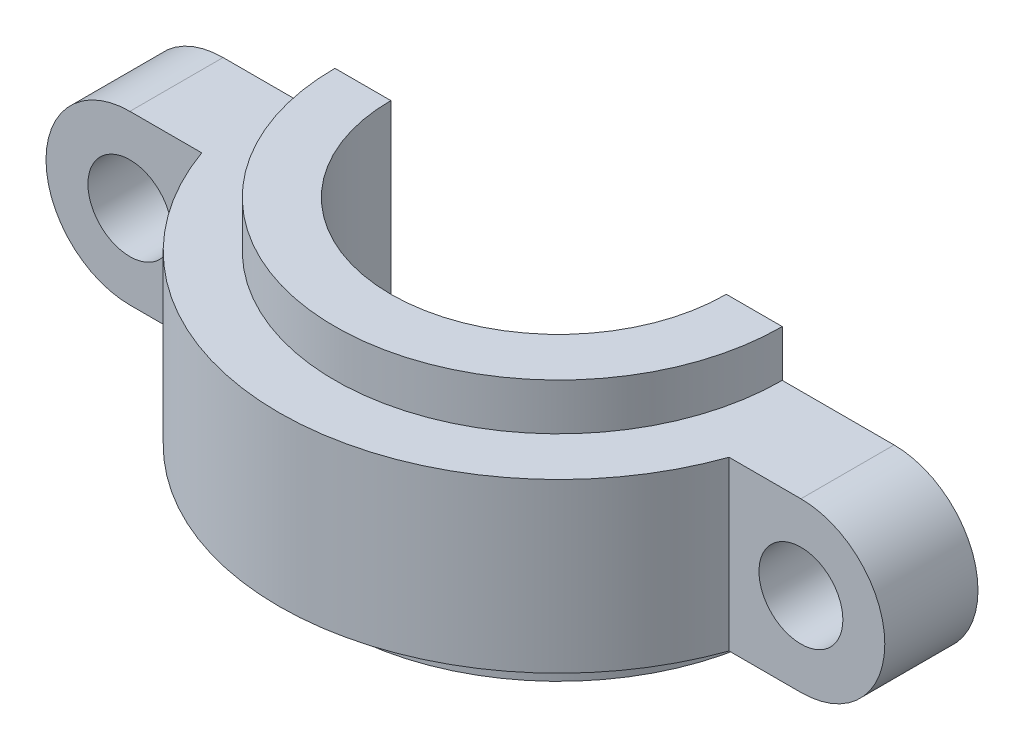
ISO-10303-21;
HEADER;
FILE_DESCRIPTION(('STEP AP214'),'2;1');
FILE_NAME('part.step','',(''),(''),'','','');
FILE_SCHEMA(('AUTOMOTIVE_DESIGN { 1 0 10303 214 1 1 1 1 }'));
ENDSEC;
DATA;
#1=APPLICATION_CONTEXT('core data for automotive mechanical design processes');
#2=APPLICATION_PROTOCOL_DEFINITION('international standard','automotive_design',2000,#1);
#3=PRODUCT_CONTEXT('',#1,'mechanical');
#4=PRODUCT('Part','Part','',(#3));
#5=PRODUCT_RELATED_PRODUCT_CATEGORY('part','',(#4));
#6=PRODUCT_DEFINITION_FORMATION('','',#4);
#7=PRODUCT_DEFINITION_CONTEXT('part definition',#1,'design');
#8=PRODUCT_DEFINITION('design','',#6,#7);
#9=PRODUCT_DEFINITION_SHAPE('','',#8);
#10=(LENGTH_UNIT() NAMED_UNIT(*) SI_UNIT(.MILLI.,.METRE.));
#11=(NAMED_UNIT(*) PLANE_ANGLE_UNIT() SI_UNIT($,.RADIAN.));
#12=(NAMED_UNIT(*) SI_UNIT($,.STERADIAN.) SOLID_ANGLE_UNIT());
#13=UNCERTAINTY_MEASURE_WITH_UNIT(LENGTH_MEASURE(1.E-05),#10,'distance_accuracy_value','');
#14=(GEOMETRIC_REPRESENTATION_CONTEXT(3) GLOBAL_UNCERTAINTY_ASSIGNED_CONTEXT((#13)) GLOBAL_UNIT_ASSIGNED_CONTEXT((#10,
#11,#12)) REPRESENTATION_CONTEXT('',''));
#15=CARTESIAN_POINT('',(0.,0.,0.));
#16=DIRECTION('',(0.,0.,1.));
#17=DIRECTION('',(1.,0.,0.));
#18=AXIS2_PLACEMENT_3D('',#15,#16,#17);
#19=CARTESIAN_POINT('',(-36.,0.,0.));
#20=DIRECTION('',(0.,0.,1.));
#21=DIRECTION('',(1.,0.,0.));
#22=AXIS2_PLACEMENT_3D('',#19,#20,#21);
#23=PLANE('',#22);
#24=CARTESIAN_POINT('',(36.,0.,0.));
#25=DIRECTION('',(0.,0.,1.));
#26=DIRECTION('',(1.,0.,0.));
#27=AXIS2_PLACEMENT_3D('',#24,#25,#26);
#28=CIRCLE('',#27,4.5);
#29=CARTESIAN_POINT('',(40.5,0.,0.));
#30=VERTEX_POINT('',#29);
#31=EDGE_CURVE('E171',#30,#30,#28,.T.);
#32=ORIENTED_EDGE('',*,*,#31,.T.);
#33=EDGE_LOOP('',(#32));
#34=FACE_BOUND('',#33,.T.);
#35=DIRECTION('',(-1.,0.,0.));
#36=VECTOR('',#35,1.);
#37=CARTESIAN_POINT('',(-24.,-14.,0.));
#38=LINE('',#37,#36);
#39=CARTESIAN_POINT('',(24.,-14.,0.));
#40=VERTEX_POINT('',#39);
#41=CARTESIAN_POINT('',(18.,-14.,0.));
#42=VERTEX_POINT('',#41);
#43=EDGE_CURVE('E144',#40,#42,#38,.T.);
#44=ORIENTED_EDGE('',*,*,#43,.T.);
#45=DIRECTION('',(0.,1.,0.));
#46=VECTOR('',#45,1.);
#47=CARTESIAN_POINT('',(18.,-14.,0.));
#48=LINE('',#47,#46);
#49=CARTESIAN_POINT('',(18.,14.,0.));
#50=VERTEX_POINT('',#49);
#51=EDGE_CURVE('E47',#42,#50,#48,.T.);
#52=ORIENTED_EDGE('',*,*,#51,.T.);
#53=DIRECTION('',(-1.,0.,0.));
#54=VECTOR('',#53,1.);
#55=CARTESIAN_POINT('',(-24.,14.,0.));
#56=LINE('',#55,#54);
#57=CARTESIAN_POINT('',(24.,14.,0.));
#58=VERTEX_POINT('',#57);
#59=EDGE_CURVE('E221',#58,#50,#56,.T.);
#60=ORIENTED_EDGE('',*,*,#59,.F.);
#61=DIRECTION('',(0.,-1.,0.));
#62=VECTOR('',#61,1.);
#63=CARTESIAN_POINT('',(24.,14.,0.));
#64=LINE('',#63,#62);
#65=CARTESIAN_POINT('',(24.,9.00000000000002,0.));
#66=VERTEX_POINT('',#65);
#67=EDGE_CURVE('E155',#58,#66,#64,.T.);
#68=ORIENTED_EDGE('',*,*,#67,.T.);
#69=DIRECTION('',(-1.,0.,0.));
#70=VECTOR('',#69,1.);
#71=CARTESIAN_POINT('',(-36.,9.00000000000001,0.));
#72=LINE('',#71,#70);
#73=CARTESIAN_POINT('',(36.,9.00000000000003,0.));
#74=VERTEX_POINT('',#73);
#75=EDGE_CURVE('E188',#74,#66,#72,.T.);
#76=ORIENTED_EDGE('',*,*,#75,.F.);
#77=CARTESIAN_POINT('',(36.,0.,0.));
#78=DIRECTION('',(0.,0.,1.));
#79=DIRECTION('',(1.,0.,0.));
#80=AXIS2_PLACEMENT_3D('',#77,#78,#79);
#81=CIRCLE('',#80,9.00000000000001);
#82=CARTESIAN_POINT('',(36.,-9.,0.));
#83=VERTEX_POINT('',#82);
#84=EDGE_CURVE('E201',#83,#74,#81,.T.);
#85=ORIENTED_EDGE('',*,*,#84,.F.);
#86=DIRECTION('',(1.,0.,0.));
#87=VECTOR('',#86,1.);
#88=CARTESIAN_POINT('',(-36.,-9.00000000000001,0.));
#89=LINE('',#88,#87);
#90=CARTESIAN_POINT('',(24.,-9.00000000000001,0.));
#91=VERTEX_POINT('',#90);
#92=EDGE_CURVE('E199',#91,#83,#89,.T.);
#93=ORIENTED_EDGE('',*,*,#92,.F.);
#94=EDGE_CURVE('E153',#91,#40,#64,.T.);
#95=ORIENTED_EDGE('',*,*,#94,.T.);
#96=EDGE_LOOP('',(#44,#52,#60,#68,#76,#85,#93,#95));
#97=FACE_BOUND('',#96,.T.);
#98=ADVANCED_FACE('F32',(#34,#97),#23,.F.);
#99=CARTESIAN_POINT('',(-36.,-9.00000000000001,10.));
#100=DIRECTION('',(0.,1.,0.));
#101=DIRECTION('',(-1.,0.,0.));
#102=AXIS2_PLACEMENT_3D('',#99,#100,#101);
#103=PLANE('',#102);
#104=CARTESIAN_POINT('',(0.,-9.00000000000001,0.));
#105=DIRECTION('',(0.,1.,0.));
#106=DIRECTION('',(-1.,0.,0.));
#107=AXIS2_PLACEMENT_3D('',#104,#105,#106);
#108=CIRCLE('',#107,24.);
#109=CARTESIAN_POINT('',(-24.,-9.00000000000001,0.));
#110=VERTEX_POINT('',#109);
#111=EDGE_CURVE('E158',#91,#110,#108,.F.);
#112=ORIENTED_EDGE('',*,*,#111,.F.);
#113=ORIENTED_EDGE('',*,*,#92,.T.);
#114=DIRECTION('',(0.,0.,-1.));
#115=VECTOR('',#114,1.);
#116=CARTESIAN_POINT('',(36.,-9.,10.));
#117=LINE('',#116,#115);
#118=CARTESIAN_POINT('',(36.,-9.,10.));
#119=VERTEX_POINT('',#118);
#120=EDGE_CURVE('E210',#119,#83,#117,.T.);
#121=ORIENTED_EDGE('',*,*,#120,.F.);
#122=DIRECTION('',(1.,0.,0.));
#123=VECTOR('',#122,1.);
#124=CARTESIAN_POINT('',(-36.,-9.00000000000001,10.));
#125=LINE('',#124,#123);
#126=CARTESIAN_POINT('',(28.2842712474619,-9.,10.));
#127=VERTEX_POINT('',#126);
#128=EDGE_CURVE('E187',#127,#119,#125,.T.);
#129=ORIENTED_EDGE('',*,*,#128,.F.);
#130=CARTESIAN_POINT('',(0.,-9.,0.));
#131=DIRECTION('',(0.,1.,0.));
#132=DIRECTION('',(0.,0.,1.));
#133=AXIS2_PLACEMENT_3D('',#130,#131,#132);
#134=CIRCLE('',#133,30.);
#135=CARTESIAN_POINT('',(-28.2842712474619,-9.00000000000001,10.));
#136=VERTEX_POINT('',#135);
#137=EDGE_CURVE('E160',#136,#127,#134,.T.);
#138=ORIENTED_EDGE('',*,*,#137,.F.);
#139=CARTESIAN_POINT('',(-36.,-9.00000000000001,10.));
#140=VERTEX_POINT('',#139);
#141=EDGE_CURVE('E189',#140,#136,#125,.T.);
#142=ORIENTED_EDGE('',*,*,#141,.F.);
#143=DIRECTION('',(0.,0.,-1.));
#144=VECTOR('',#143,1.);
#145=CARTESIAN_POINT('',(-36.,-9.00000000000001,10.));
#146=LINE('',#145,#144);
#147=CARTESIAN_POINT('',(-36.,-9.00000000000001,0.));
#148=VERTEX_POINT('',#147);
#149=EDGE_CURVE('E40',#140,#148,#146,.T.);
#150=ORIENTED_EDGE('',*,*,#149,.T.);
#151=EDGE_CURVE('E55',#148,#110,#89,.T.);
#152=ORIENTED_EDGE('',*,*,#151,.T.);
#153=EDGE_LOOP('',(#112,#113,#121,#129,#138,#142,#150,#152));
#154=FACE_BOUND('',#153,.T.);
#155=ADVANCED_FACE('F213',(#154),#103,.F.);
#156=CARTESIAN_POINT('',(-36.,9.00000000000001,10.));
#157=DIRECTION('',(0.,-1.,0.));
#158=DIRECTION('',(1.,0.,0.));
#159=AXIS2_PLACEMENT_3D('',#156,#157,#158);
#160=PLANE('',#159);
#161=CARTESIAN_POINT('',(0.,9.00000000000002,0.));
#162=DIRECTION('',(0.,-1.,0.));
#163=DIRECTION('',(1.,0.,0.));
#164=AXIS2_PLACEMENT_3D('',#161,#162,#163);
#165=CIRCLE('',#164,24.);
#166=CARTESIAN_POINT('',(-24.,9.00000000000002,0.));
#167=VERTEX_POINT('',#166);
#168=EDGE_CURVE('E11',#167,#66,#165,.F.);
#169=ORIENTED_EDGE('',*,*,#168,.F.);
#170=CARTESIAN_POINT('',(-36.,9.00000000000001,0.));
#171=VERTEX_POINT('',#170);
#172=EDGE_CURVE('E203',#167,#171,#72,.T.);
#173=ORIENTED_EDGE('',*,*,#172,.T.);
#174=DIRECTION('',(0.,0.,-1.));
#175=VECTOR('',#174,1.);
#176=CARTESIAN_POINT('',(-36.,9.00000000000001,10.));
#177=LINE('',#176,#175);
#178=CARTESIAN_POINT('',(-36.,9.00000000000001,10.));
#179=VERTEX_POINT('',#178);
#180=EDGE_CURVE('E196',#179,#171,#177,.T.);
#181=ORIENTED_EDGE('',*,*,#180,.F.);
#182=DIRECTION('',(-1.,0.,0.));
#183=VECTOR('',#182,1.);
#184=CARTESIAN_POINT('',(-36.,9.00000000000001,10.));
#185=LINE('',#184,#183);
#186=CARTESIAN_POINT('',(-28.2842712474619,9.00000000000001,10.));
#187=VERTEX_POINT('',#186);
#188=EDGE_CURVE('E193',#187,#179,#185,.T.);
#189=ORIENTED_EDGE('',*,*,#188,.F.);
#190=CARTESIAN_POINT('',(0.,9.,0.));
#191=DIRECTION('',(0.,1.,0.));
#192=DIRECTION('',(0.,0.,1.));
#193=AXIS2_PLACEMENT_3D('',#190,#191,#192);
#194=CIRCLE('',#193,30.);
#195=CARTESIAN_POINT('',(28.2842712474619,9.00000000000002,10.));
#196=VERTEX_POINT('',#195);
#197=EDGE_CURVE('E161',#187,#196,#194,.T.);
#198=ORIENTED_EDGE('',*,*,#197,.T.);
#199=CARTESIAN_POINT('',(36.,9.00000000000003,10.));
#200=VERTEX_POINT('',#199);
#201=EDGE_CURVE('E194',#200,#196,#185,.T.);
#202=ORIENTED_EDGE('',*,*,#201,.F.);
#203=DIRECTION('',(0.,0.,-1.));
#204=VECTOR('',#203,1.);
#205=CARTESIAN_POINT('',(36.,9.00000000000003,10.));
#206=LINE('',#205,#204);
#207=EDGE_CURVE('E207',#200,#74,#206,.T.);
#208=ORIENTED_EDGE('',*,*,#207,.T.);
#209=ORIENTED_EDGE('',*,*,#75,.T.);
#210=EDGE_LOOP('',(#169,#173,#181,#189,#198,#202,#208,#209));
#211=FACE_BOUND('',#210,.T.);
#212=ADVANCED_FACE('F240',(#211),#160,.F.);
#213=CARTESIAN_POINT('',(-36.,0.,10.));
#214=DIRECTION('',(0.,0.,1.));
#215=DIRECTION('',(1.,0.,0.));
#216=AXIS2_PLACEMENT_3D('',#213,#214,#215);
#217=PLANE('',#216);
#218=CARTESIAN_POINT('',(-36.,0.,10.));
#219=DIRECTION('',(0.,0.,1.));
#220=DIRECTION('',(-1.,0.,0.));
#221=AXIS2_PLACEMENT_3D('',#218,#219,#220);
#222=CIRCLE('',#221,4.5);
#223=CARTESIAN_POINT('',(-40.5,0.,10.));
#224=VERTEX_POINT('',#223);
#225=EDGE_CURVE('E178',#224,#224,#222,.T.);
#226=ORIENTED_EDGE('',*,*,#225,.F.);
#227=EDGE_LOOP('',(#226));
#228=FACE_BOUND('',#227,.T.);
#229=ORIENTED_EDGE('',*,*,#141,.T.);
#230=DIRECTION('',(0.,-1.,0.));
#231=VECTOR('',#230,1.);
#232=CARTESIAN_POINT('',(-28.2842712474619,9.,10.));
#233=LINE('',#232,#231);
#234=EDGE_CURVE('E169',#136,#187,#233,.F.);
#235=ORIENTED_EDGE('',*,*,#234,.T.);
#236=ORIENTED_EDGE('',*,*,#188,.T.);
#237=CARTESIAN_POINT('',(-36.,0.,10.));
#238=DIRECTION('',(0.,0.,1.));
#239=DIRECTION('',(1.,0.,0.));
#240=AXIS2_PLACEMENT_3D('',#237,#238,#239);
#241=CIRCLE('',#240,9.00000000000001);
#242=EDGE_CURVE('E184',#179,#140,#241,.T.);
#243=ORIENTED_EDGE('',*,*,#242,.T.);
#244=EDGE_LOOP('',(#229,#235,#236,#243));
#245=FACE_BOUND('',#244,.T.);
#246=ADVANCED_FACE('F273',(#228,#245),#217,.T.);
#247=CARTESIAN_POINT('',(36.,0.,10.));
#248=DIRECTION('',(0.,0.,1.));
#249=DIRECTION('',(1.,0.,0.));
#250=AXIS2_PLACEMENT_3D('',#247,#248,#249);
#251=CIRCLE('',#250,4.5);
#252=CARTESIAN_POINT('',(40.5,0.,10.));
#253=VERTEX_POINT('',#252);
#254=EDGE_CURVE('E172',#253,#253,#251,.T.);
#255=ORIENTED_EDGE('',*,*,#254,.F.);
#256=EDGE_LOOP('',(#255));
#257=FACE_BOUND('',#256,.T.);
#258=ORIENTED_EDGE('',*,*,#201,.T.);
#259=DIRECTION('',(0.,-1.,0.));
#260=VECTOR('',#259,1.);
#261=CARTESIAN_POINT('',(28.2842712474619,9.,10.));
#262=LINE('',#261,#260);
#263=EDGE_CURVE('E164',#196,#127,#262,.T.);
#264=ORIENTED_EDGE('',*,*,#263,.T.);
#265=ORIENTED_EDGE('',*,*,#128,.T.);
#266=CARTESIAN_POINT('',(36.,0.,10.));
#267=DIRECTION('',(0.,0.,1.));
#268=DIRECTION('',(1.,0.,0.));
#269=AXIS2_PLACEMENT_3D('',#266,#267,#268);
#270=CIRCLE('',#269,9.00000000000001);
#271=EDGE_CURVE('E191',#119,#200,#270,.T.);
#272=ORIENTED_EDGE('',*,*,#271,.T.);
#273=EDGE_LOOP('',(#258,#264,#265,#272));
#274=FACE_BOUND('',#273,.T.);
#275=ADVANCED_FACE('F268',(#257,#274),#217,.T.);
#276=CARTESIAN_POINT('',(-18.,14.,0.));
#277=VERTEX_POINT('',#276);
#278=CARTESIAN_POINT('',(-24.,14.,0.));
#279=VERTEX_POINT('',#278);
#280=EDGE_CURVE('E138',#277,#279,#56,.T.);
#281=ORIENTED_EDGE('',*,*,#280,.F.);
#282=DIRECTION('',(0.,1.,0.));
#283=VECTOR('',#282,1.);
#284=CARTESIAN_POINT('',(-18.,-14.,0.));
#285=LINE('',#284,#283);
#286=CARTESIAN_POINT('',(-18.,-14.,0.));
#287=VERTEX_POINT('',#286);
#288=EDGE_CURVE('E122',#287,#277,#285,.T.);
#289=ORIENTED_EDGE('',*,*,#288,.F.);
#290=CARTESIAN_POINT('',(-24.,-14.,0.));
#291=VERTEX_POINT('',#290);
#292=EDGE_CURVE('E135',#287,#291,#38,.T.);
#293=ORIENTED_EDGE('',*,*,#292,.T.);
#294=DIRECTION('',(0.,-1.,0.));
#295=VECTOR('',#294,1.);
#296=CARTESIAN_POINT('',(-24.,14.,0.));
#297=LINE('',#296,#295);
#298=EDGE_CURVE('E154',#110,#291,#297,.T.);
#299=ORIENTED_EDGE('',*,*,#298,.F.);
#300=ORIENTED_EDGE('',*,*,#151,.F.);
#301=CARTESIAN_POINT('',(-36.,0.,0.));
#302=DIRECTION('',(0.,0.,1.));
#303=DIRECTION('',(1.,0.,0.));
#304=AXIS2_PLACEMENT_3D('',#301,#302,#303);
#305=CIRCLE('',#304,9.00000000000001);
#306=EDGE_CURVE('E181',#171,#148,#305,.T.);
#307=ORIENTED_EDGE('',*,*,#306,.F.);
#308=ORIENTED_EDGE('',*,*,#172,.F.);
#309=EDGE_CURVE('E150',#279,#167,#297,.T.);
#310=ORIENTED_EDGE('',*,*,#309,.F.);
#311=EDGE_LOOP('',(#281,#289,#293,#299,#300,#307,#308,#310));
#312=FACE_BOUND('',#311,.T.);
#313=CARTESIAN_POINT('',(-36.,0.,0.));
#314=DIRECTION('',(0.,0.,1.));
#315=DIRECTION('',(-1.,0.,0.));
#316=AXIS2_PLACEMENT_3D('',#313,#314,#315);
#317=CIRCLE('',#316,4.5);
#318=CARTESIAN_POINT('',(-40.5,0.,0.));
#319=VERTEX_POINT('',#318);
#320=EDGE_CURVE('E175',#319,#319,#317,.T.);
#321=ORIENTED_EDGE('',*,*,#320,.T.);
#322=EDGE_LOOP('',(#321));
#323=FACE_BOUND('',#322,.T.);
#324=ADVANCED_FACE('F132',(#312,#323),#23,.F.);
#325=CARTESIAN_POINT('',(-36.,0.,10.));
#326=DIRECTION('',(0.,0.,-1.));
#327=DIRECTION('',(-1.,0.,0.));
#328=AXIS2_PLACEMENT_3D('',#325,#326,#327);
#329=CYLINDRICAL_SURFACE('',#328,9.00000000000001);
#330=ORIENTED_EDGE('',*,*,#306,.T.);
#331=ORIENTED_EDGE('',*,*,#149,.F.);
#332=ORIENTED_EDGE('',*,*,#242,.F.);
#333=ORIENTED_EDGE('',*,*,#180,.T.);
#334=EDGE_LOOP('',(#330,#331,#332,#333));
#335=FACE_BOUND('',#334,.T.);
#336=ADVANCED_FACE('F34',(#335),#329,.T.);
#337=CARTESIAN_POINT('',(36.,0.,10.));
#338=DIRECTION('',(0.,0.,-1.));
#339=DIRECTION('',(-1.,0.,0.));
#340=AXIS2_PLACEMENT_3D('',#337,#338,#339);
#341=CYLINDRICAL_SURFACE('',#340,9.00000000000001);
#342=ORIENTED_EDGE('',*,*,#84,.T.);
#343=ORIENTED_EDGE('',*,*,#207,.F.);
#344=ORIENTED_EDGE('',*,*,#271,.F.);
#345=ORIENTED_EDGE('',*,*,#120,.T.);
#346=EDGE_LOOP('',(#342,#343,#344,#345));
#347=FACE_BOUND('',#346,.T.);
#348=ADVANCED_FACE('F235',(#347),#341,.T.);
#349=CARTESIAN_POINT('',(-36.,0.,10.));
#350=DIRECTION('',(0.,0.,-1.));
#351=DIRECTION('',(-1.,0.,0.));
#352=AXIS2_PLACEMENT_3D('',#349,#350,#351);
#353=CYLINDRICAL_SURFACE('',#352,4.5);
#354=ORIENTED_EDGE('',*,*,#225,.T.);
#355=EDGE_LOOP('',(#354));
#356=FACE_BOUND('',#355,.T.);
#357=ORIENTED_EDGE('',*,*,#320,.F.);
#358=EDGE_LOOP('',(#357));
#359=FACE_BOUND('',#358,.T.);
#360=ADVANCED_FACE('F282',(#356,#359),#353,.F.);
#361=CARTESIAN_POINT('',(36.,0.,10.));
#362=DIRECTION('',(0.,0.,-1.));
#363=DIRECTION('',(-1.,0.,0.));
#364=AXIS2_PLACEMENT_3D('',#361,#362,#363);
#365=CYLINDRICAL_SURFACE('',#364,4.5);
#366=ORIENTED_EDGE('',*,*,#254,.T.);
#367=EDGE_LOOP('',(#366));
#368=FACE_BOUND('',#367,.T.);
#369=ORIENTED_EDGE('',*,*,#31,.F.);
#370=EDGE_LOOP('',(#369));
#371=FACE_BOUND('',#370,.T.);
#372=ADVANCED_FACE('F254',(#368,#371),#365,.F.);
#373=CARTESIAN_POINT('',(0.,9.,0.));
#374=DIRECTION('',(0.,-1.,0.));
#375=DIRECTION('',(0.,0.,-1.));
#376=AXIS2_PLACEMENT_3D('',#373,#374,#375);
#377=CYLINDRICAL_SURFACE('',#376,30.);
#378=ORIENTED_EDGE('',*,*,#234,.F.);
#379=ORIENTED_EDGE('',*,*,#137,.T.);
#380=ORIENTED_EDGE('',*,*,#263,.F.);
#381=ORIENTED_EDGE('',*,*,#197,.F.);
#382=EDGE_LOOP('',(#378,#379,#380,#381));
#383=FACE_BOUND('',#382,.T.);
#384=ADVANCED_FACE('F247',(#383),#377,.T.);
#385=CARTESIAN_POINT('',(0.,14.,0.));
#386=DIRECTION('',(0.,1.,0.));
#387=DIRECTION('',(0.,0.,1.));
#388=AXIS2_PLACEMENT_3D('',#385,#386,#387);
#389=PLANE('',#388);
#390=CARTESIAN_POINT('',(0.,14.,0.));
#391=DIRECTION('',(0.,1.,0.));
#392=DIRECTION('',(0.,0.,1.));
#393=AXIS2_PLACEMENT_3D('',#390,#391,#392);
#394=CIRCLE('',#393,18.);
#395=EDGE_CURVE('E128',#277,#50,#394,.T.);
#396=ORIENTED_EDGE('',*,*,#395,.F.);
#397=ORIENTED_EDGE('',*,*,#280,.T.);
#398=CARTESIAN_POINT('',(0.,14.,0.));
#399=DIRECTION('',(0.,1.,0.));
#400=DIRECTION('',(0.,0.,1.));
#401=AXIS2_PLACEMENT_3D('',#398,#399,#400);
#402=CIRCLE('',#401,24.);
#403=EDGE_CURVE('E146',#279,#58,#402,.T.);
#404=ORIENTED_EDGE('',*,*,#403,.T.);
#405=ORIENTED_EDGE('',*,*,#59,.T.);
#406=EDGE_LOOP('',(#396,#397,#404,#405));
#407=FACE_BOUND('',#406,.T.);
#408=ADVANCED_FACE('F245',(#407),#389,.T.);
#409=CARTESIAN_POINT('',(0.,14.,0.));
#410=DIRECTION('',(0.,-1.,0.));
#411=DIRECTION('',(0.,0.,-1.));
#412=AXIS2_PLACEMENT_3D('',#409,#410,#411);
#413=CYLINDRICAL_SURFACE('',#412,24.);
#414=ORIENTED_EDGE('',*,*,#309,.T.);
#415=ORIENTED_EDGE('',*,*,#168,.T.);
#416=ORIENTED_EDGE('',*,*,#67,.F.);
#417=ORIENTED_EDGE('',*,*,#403,.F.);
#418=EDGE_LOOP('',(#414,#415,#416,#417));
#419=FACE_BOUND('',#418,.T.);
#420=ADVANCED_FACE('F243',(#419),#413,.T.);
#421=ORIENTED_EDGE('',*,*,#94,.F.);
#422=ORIENTED_EDGE('',*,*,#111,.T.);
#423=ORIENTED_EDGE('',*,*,#298,.T.);
#424=CARTESIAN_POINT('',(0.,-14.,0.));
#425=DIRECTION('',(0.,1.,0.));
#426=DIRECTION('',(0.,0.,1.));
#427=AXIS2_PLACEMENT_3D('',#424,#425,#426);
#428=CIRCLE('',#427,24.);
#429=EDGE_CURVE('E139',#291,#40,#428,.T.);
#430=ORIENTED_EDGE('',*,*,#429,.T.);
#431=EDGE_LOOP('',(#421,#422,#423,#430));
#432=FACE_BOUND('',#431,.T.);
#433=ADVANCED_FACE('F230',(#432),#413,.T.);
#434=CARTESIAN_POINT('',(0.,-14.,0.));
#435=DIRECTION('',(0.,1.,0.));
#436=DIRECTION('',(0.,0.,1.));
#437=AXIS2_PLACEMENT_3D('',#434,#435,#436);
#438=PLANE('',#437);
#439=ORIENTED_EDGE('',*,*,#292,.F.);
#440=CARTESIAN_POINT('',(0.,-14.,0.));
#441=DIRECTION('',(0.,1.,0.));
#442=DIRECTION('',(0.,0.,1.));
#443=AXIS2_PLACEMENT_3D('',#440,#441,#442);
#444=CIRCLE('',#443,18.);
#445=EDGE_CURVE('E119',#287,#42,#444,.T.);
#446=ORIENTED_EDGE('',*,*,#445,.T.);
#447=ORIENTED_EDGE('',*,*,#43,.F.);
#448=ORIENTED_EDGE('',*,*,#429,.F.);
#449=EDGE_LOOP('',(#439,#446,#447,#448));
#450=FACE_BOUND('',#449,.T.);
#451=ADVANCED_FACE('F142',(#450),#438,.F.);
#452=CARTESIAN_POINT('',(0.,-14.,0.));
#453=DIRECTION('',(0.,1.,0.));
#454=DIRECTION('',(0.,0.,1.));
#455=AXIS2_PLACEMENT_3D('',#452,#453,#454);
#456=CYLINDRICAL_SURFACE('',#455,18.);
#457=ORIENTED_EDGE('',*,*,#395,.T.);
#458=ORIENTED_EDGE('',*,*,#51,.F.);
#459=ORIENTED_EDGE('',*,*,#445,.F.);
#460=ORIENTED_EDGE('',*,*,#288,.T.);
#461=EDGE_LOOP('',(#457,#458,#459,#460));
#462=FACE_BOUND('',#461,.T.);
#463=ADVANCED_FACE('F121',(#462),#456,.F.);
#464=CLOSED_SHELL('',(#98,#155,#212,#246,#275,#324,#336,#348,#360,#372,#384,#408,#420,#433,#451,#463));
#465=MANIFOLD_SOLID_BREP('B2',#464);
#466=ADVANCED_BREP_SHAPE_REPRESENTATION('',(#18,#465),#14);
#467=SHAPE_DEFINITION_REPRESENTATION(#9,#466);
ENDSEC;
END-ISO-10303-21;
